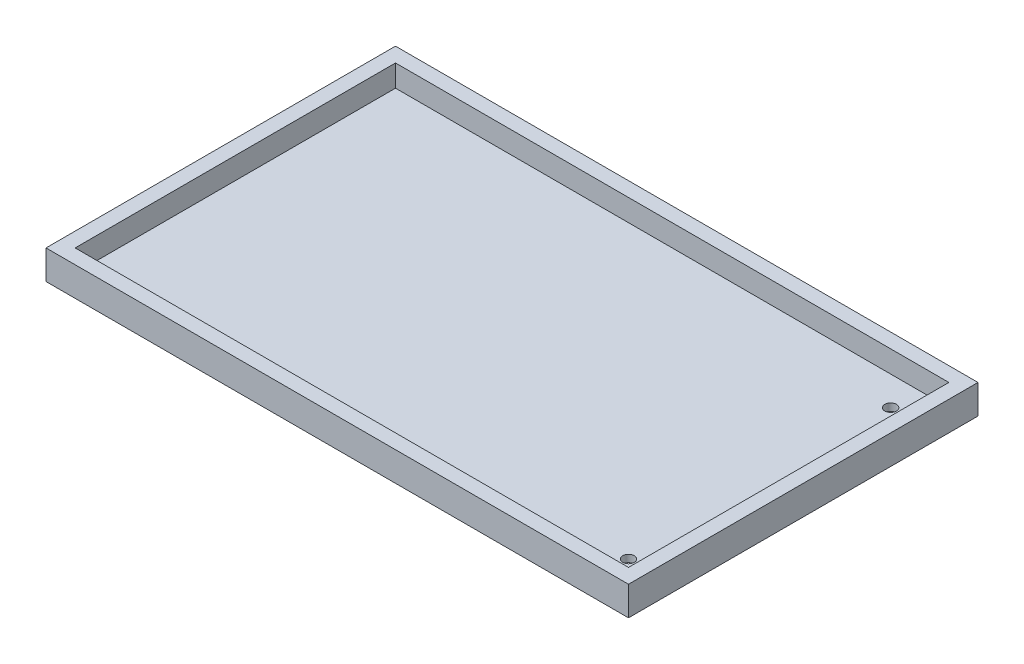
ISO-10303-21;
HEADER;
FILE_DESCRIPTION(('STEP AP214'),'2;1');
FILE_NAME('part.step','',(''),(''),'','','');
FILE_SCHEMA(('AUTOMOTIVE_DESIGN { 1 0 10303 214 1 1 1 1 }'));
ENDSEC;
DATA;
#1=APPLICATION_CONTEXT('core data for automotive mechanical design processes');
#2=APPLICATION_PROTOCOL_DEFINITION('international standard','automotive_design',2000,#1);
#3=PRODUCT_CONTEXT('',#1,'mechanical');
#4=PRODUCT('Part','Part','',(#3));
#5=PRODUCT_RELATED_PRODUCT_CATEGORY('part','',(#4));
#6=PRODUCT_DEFINITION_FORMATION('','',#4);
#7=PRODUCT_DEFINITION_CONTEXT('part definition',#1,'design');
#8=PRODUCT_DEFINITION('design','',#6,#7);
#9=PRODUCT_DEFINITION_SHAPE('','',#8);
#10=(LENGTH_UNIT() NAMED_UNIT(*) SI_UNIT(.MILLI.,.METRE.));
#11=(NAMED_UNIT(*) PLANE_ANGLE_UNIT() SI_UNIT($,.RADIAN.));
#12=(NAMED_UNIT(*) SI_UNIT($,.STERADIAN.) SOLID_ANGLE_UNIT());
#13=UNCERTAINTY_MEASURE_WITH_UNIT(LENGTH_MEASURE(1.E-05),#10,'distance_accuracy_value','');
#14=(GEOMETRIC_REPRESENTATION_CONTEXT(3) GLOBAL_UNCERTAINTY_ASSIGNED_CONTEXT((#13)) GLOBAL_UNIT_ASSIGNED_CONTEXT((#10,
#11,#12)) REPRESENTATION_CONTEXT('',''));
#15=CARTESIAN_POINT('',(0.,0.,0.));
#16=DIRECTION('',(0.,0.,1.));
#17=DIRECTION('',(1.,0.,0.));
#18=AXIS2_PLACEMENT_3D('',#15,#16,#17);
#19=CARTESIAN_POINT('',(-67.6959638652054,5.08,-25.0731617647059));
#20=DIRECTION('',(1.,0.,0.));
#21=DIRECTION('',(0.,0.,-1.));
#22=AXIS2_PLACEMENT_3D('',#19,#20,#21);
#23=PLANE('',#22);
#24=DIRECTION('',(0.,0.,1.));
#25=VECTOR('',#24,1.);
#26=CARTESIAN_POINT('',(-67.6959638652054,0.,-25.0731617647059));
#27=LINE('',#26,#25);
#28=CARTESIAN_POINT('',(-67.6959638652054,0.,-25.0731617647059));
#29=VERTEX_POINT('',#28);
#30=CARTESIAN_POINT('',(-67.6959638652054,0.,35.8868382352941));
#31=VERTEX_POINT('',#30);
#32=EDGE_CURVE('E161',#29,#31,#27,.T.);
#33=ORIENTED_EDGE('',*,*,#32,.T.);
#34=DIRECTION('',(0.,-1.,0.));
#35=VECTOR('',#34,1.);
#36=CARTESIAN_POINT('',(-67.6959638652054,5.08,35.8868382352941));
#37=LINE('',#36,#35);
#38=CARTESIAN_POINT('',(-67.6959638652054,5.08,35.8868382352941));
#39=VERTEX_POINT('',#38);
#40=EDGE_CURVE('E11',#39,#31,#37,.T.);
#41=ORIENTED_EDGE('',*,*,#40,.F.);
#42=DIRECTION('',(0.,0.,1.));
#43=VECTOR('',#42,1.);
#44=CARTESIAN_POINT('',(-67.6959638652054,5.08,-25.0731617647059));
#45=LINE('',#44,#43);
#46=CARTESIAN_POINT('',(-67.6959638652054,5.08,-25.0731617647059));
#47=VERTEX_POINT('',#46);
#48=EDGE_CURVE('E167',#47,#39,#45,.T.);
#49=ORIENTED_EDGE('',*,*,#48,.F.);
#50=DIRECTION('',(0.,-1.,0.));
#51=VECTOR('',#50,1.);
#52=CARTESIAN_POINT('',(-67.6959638652054,5.08,-25.0731617647059));
#53=LINE('',#52,#51);
#54=EDGE_CURVE('E177',#47,#29,#53,.T.);
#55=ORIENTED_EDGE('',*,*,#54,.T.);
#56=EDGE_LOOP('',(#33,#41,#49,#55));
#57=FACE_BOUND('',#56,.T.);
#58=ADVANCED_FACE('F39',(#57),#23,.F.);
#59=CARTESIAN_POINT('',(-67.6959638652054,5.08,35.8868382352941));
#60=DIRECTION('',(0.,0.,-1.));
#61=DIRECTION('',(-1.,0.,0.));
#62=AXIS2_PLACEMENT_3D('',#59,#60,#61);
#63=PLANE('',#62);
#64=DIRECTION('',(1.,0.,0.));
#65=VECTOR('',#64,1.);
#66=CARTESIAN_POINT('',(-67.6959638652054,0.,35.8868382352941));
#67=LINE('',#66,#65);
#68=CARTESIAN_POINT('',(33.9040361347946,0.,35.8868382352941));
#69=VERTEX_POINT('',#68);
#70=EDGE_CURVE('E181',#31,#69,#67,.T.);
#71=ORIENTED_EDGE('',*,*,#70,.T.);
#72=DIRECTION('',(0.,-1.,0.));
#73=VECTOR('',#72,1.);
#74=CARTESIAN_POINT('',(33.9040361347946,5.08,35.8868382352941));
#75=LINE('',#74,#73);
#76=CARTESIAN_POINT('',(33.9040361347946,5.08,35.8868382352941));
#77=VERTEX_POINT('',#76);
#78=EDGE_CURVE('E47',#77,#69,#75,.T.);
#79=ORIENTED_EDGE('',*,*,#78,.F.);
#80=DIRECTION('',(1.,0.,0.));
#81=VECTOR('',#80,1.);
#82=CARTESIAN_POINT('',(-67.6959638652054,5.08,35.8868382352941));
#83=LINE('',#82,#81);
#84=EDGE_CURVE('E91',#39,#77,#83,.T.);
#85=ORIENTED_EDGE('',*,*,#84,.F.);
#86=ORIENTED_EDGE('',*,*,#40,.T.);
#87=EDGE_LOOP('',(#71,#79,#85,#86));
#88=FACE_BOUND('',#87,.T.);
#89=ADVANCED_FACE('F216',(#88),#63,.F.);
#90=CARTESIAN_POINT('',(33.9040361347946,5.08,-25.0731617647059));
#91=DIRECTION('',(-1.,0.,0.));
#92=DIRECTION('',(0.,0.,1.));
#93=AXIS2_PLACEMENT_3D('',#90,#91,#92);
#94=PLANE('',#93);
#95=DIRECTION('',(0.,0.,-1.));
#96=VECTOR('',#95,1.);
#97=CARTESIAN_POINT('',(33.9040361347946,0.,-25.0731617647059));
#98=LINE('',#97,#96);
#99=CARTESIAN_POINT('',(33.9040361347946,0.,-25.0731617647059));
#100=VERTEX_POINT('',#99);
#101=EDGE_CURVE('E184',#69,#100,#98,.T.);
#102=ORIENTED_EDGE('',*,*,#101,.T.);
#103=DIRECTION('',(0.,-1.,0.));
#104=VECTOR('',#103,1.);
#105=CARTESIAN_POINT('',(33.9040361347946,5.08,-25.0731617647059));
#106=LINE('',#105,#104);
#107=CARTESIAN_POINT('',(33.9040361347946,5.08,-25.0731617647059));
#108=VERTEX_POINT('',#107);
#109=EDGE_CURVE('E191',#108,#100,#106,.T.);
#110=ORIENTED_EDGE('',*,*,#109,.F.);
#111=DIRECTION('',(0.,0.,-1.));
#112=VECTOR('',#111,1.);
#113=CARTESIAN_POINT('',(33.9040361347946,5.08,-25.0731617647059));
#114=LINE('',#113,#112);
#115=EDGE_CURVE('E172',#77,#108,#114,.T.);
#116=ORIENTED_EDGE('',*,*,#115,.F.);
#117=ORIENTED_EDGE('',*,*,#78,.T.);
#118=EDGE_LOOP('',(#102,#110,#116,#117));
#119=FACE_BOUND('',#118,.T.);
#120=ADVANCED_FACE('F198',(#119),#94,.F.);
#121=CARTESIAN_POINT('',(-67.6959638652054,5.08,-25.0731617647059));
#122=DIRECTION('',(0.,0.,1.));
#123=DIRECTION('',(1.,0.,0.));
#124=AXIS2_PLACEMENT_3D('',#121,#122,#123);
#125=PLANE('',#124);
#126=DIRECTION('',(-1.,0.,0.));
#127=VECTOR('',#126,1.);
#128=CARTESIAN_POINT('',(-67.6959638652054,0.,-25.0731617647059));
#129=LINE('',#128,#127);
#130=EDGE_CURVE('E84',#100,#29,#129,.T.);
#131=ORIENTED_EDGE('',*,*,#130,.T.);
#132=ORIENTED_EDGE('',*,*,#54,.F.);
#133=DIRECTION('',(-1.,0.,0.));
#134=VECTOR('',#133,1.);
#135=CARTESIAN_POINT('',(-67.6959638652054,5.08,-25.0731617647059));
#136=LINE('',#135,#134);
#137=EDGE_CURVE('E63',#108,#47,#136,.T.);
#138=ORIENTED_EDGE('',*,*,#137,.F.);
#139=ORIENTED_EDGE('',*,*,#109,.T.);
#140=EDGE_LOOP('',(#131,#132,#138,#139));
#141=FACE_BOUND('',#140,.T.);
#142=ADVANCED_FACE('F206',(#141),#125,.F.);
#143=CARTESIAN_POINT('',(0.,5.08,0.));
#144=DIRECTION('',(0.,1.,0.));
#145=DIRECTION('',(0.,0.,1.));
#146=AXIS2_PLACEMENT_3D('',#143,#144,#145);
#147=PLANE('',#146);
#148=DIRECTION('',(0.,0.,1.));
#149=VECTOR('',#148,1.);
#150=CARTESIAN_POINT('',(-65.1559638652054,5.08,-22.5331617647059));
#151=LINE('',#150,#149);
#152=CARTESIAN_POINT('',(-65.1559638652054,5.08,-22.5331617647059));
#153=VERTEX_POINT('',#152);
#154=CARTESIAN_POINT('',(-65.1559638652054,5.08,33.3468382352941));
#155=VERTEX_POINT('',#154);
#156=EDGE_CURVE('E54',#153,#155,#151,.T.);
#157=ORIENTED_EDGE('',*,*,#156,.F.);
#158=DIRECTION('',(-1.,0.,0.));
#159=VECTOR('',#158,1.);
#160=CARTESIAN_POINT('',(-65.1559638652054,5.08,-22.5331617647059));
#161=LINE('',#160,#159);
#162=CARTESIAN_POINT('',(31.3640361347946,5.08,-22.5331617647059));
#163=VERTEX_POINT('',#162);
#164=EDGE_CURVE('E136',#163,#153,#161,.T.);
#165=ORIENTED_EDGE('',*,*,#164,.F.);
#166=DIRECTION('',(0.,0.,-1.));
#167=VECTOR('',#166,1.);
#168=CARTESIAN_POINT('',(31.3640361347946,5.08,-22.5331617647059));
#169=LINE('',#168,#167);
#170=CARTESIAN_POINT('',(31.3640361347946,5.08,33.3468382352941));
#171=VERTEX_POINT('',#170);
#172=EDGE_CURVE('E140',#171,#163,#169,.T.);
#173=ORIENTED_EDGE('',*,*,#172,.F.);
#174=DIRECTION('',(1.,0.,0.));
#175=VECTOR('',#174,1.);
#176=CARTESIAN_POINT('',(-65.1559638652054,5.08,33.3468382352941));
#177=LINE('',#176,#175);
#178=EDGE_CURVE('E152',#155,#171,#177,.T.);
#179=ORIENTED_EDGE('',*,*,#178,.F.);
#180=EDGE_LOOP('',(#157,#165,#173,#179));
#181=FACE_BOUND('',#180,.T.);
#182=ORIENTED_EDGE('',*,*,#48,.T.);
#183=ORIENTED_EDGE('',*,*,#84,.T.);
#184=ORIENTED_EDGE('',*,*,#115,.T.);
#185=ORIENTED_EDGE('',*,*,#137,.T.);
#186=EDGE_LOOP('',(#182,#183,#184,#185));
#187=FACE_BOUND('',#186,.T.);
#188=ADVANCED_FACE('F208',(#181,#187),#147,.T.);
#189=CARTESIAN_POINT('',(0.,0.,0.));
#190=DIRECTION('',(0.,1.,0.));
#191=DIRECTION('',(0.,0.,1.));
#192=AXIS2_PLACEMENT_3D('',#189,#190,#191);
#193=PLANE('',#192);
#194=CARTESIAN_POINT('',(26.2840361347946,0.,-17.4531617647059));
#195=DIRECTION('',(0.,1.,0.));
#196=DIRECTION('',(0.,0.,1.));
#197=AXIS2_PLACEMENT_3D('',#194,#195,#196);
#198=CIRCLE('',#197,1.016);
#199=CARTESIAN_POINT('',(26.2840361347946,0.,-16.4371617647059));
#200=VERTEX_POINT('',#199);
#201=EDGE_CURVE('E143',#200,#200,#198,.T.);
#202=ORIENTED_EDGE('',*,*,#201,.T.);
#203=EDGE_LOOP('',(#202));
#204=FACE_BOUND('',#203,.T.);
#205=CARTESIAN_POINT('',(26.2840361347946,0.,28.2668382352941));
#206=DIRECTION('',(0.,1.,0.));
#207=DIRECTION('',(0.,0.,1.));
#208=AXIS2_PLACEMENT_3D('',#205,#206,#207);
#209=CIRCLE('',#208,1.016);
#210=CARTESIAN_POINT('',(26.2840361347946,0.,29.2828382352941));
#211=VERTEX_POINT('',#210);
#212=EDGE_CURVE('E323',#211,#211,#209,.T.);
#213=ORIENTED_EDGE('',*,*,#212,.T.);
#214=EDGE_LOOP('',(#213));
#215=FACE_BOUND('',#214,.T.);
#216=ORIENTED_EDGE('',*,*,#32,.F.);
#217=ORIENTED_EDGE('',*,*,#130,.F.);
#218=ORIENTED_EDGE('',*,*,#101,.F.);
#219=ORIENTED_EDGE('',*,*,#70,.F.);
#220=EDGE_LOOP('',(#216,#217,#218,#219));
#221=FACE_BOUND('',#220,.T.);
#222=ADVANCED_FACE('F202',(#204,#215,#221),#193,.F.);
#223=CARTESIAN_POINT('',(-65.1559638652054,1.27,-22.5331617647059));
#224=DIRECTION('',(-1.,0.,0.));
#225=DIRECTION('',(0.,0.,1.));
#226=AXIS2_PLACEMENT_3D('',#223,#224,#225);
#227=PLANE('',#226);
#228=ORIENTED_EDGE('',*,*,#156,.T.);
#229=DIRECTION('',(0.,1.,0.));
#230=VECTOR('',#229,1.);
#231=CARTESIAN_POINT('',(-65.1559638652054,1.27,33.3468382352941));
#232=LINE('',#231,#230);
#233=CARTESIAN_POINT('',(-65.1559638652054,1.27,33.3468382352941));
#234=VERTEX_POINT('',#233);
#235=EDGE_CURVE('E111',#234,#155,#232,.T.);
#236=ORIENTED_EDGE('',*,*,#235,.F.);
#237=DIRECTION('',(0.,0.,1.));
#238=VECTOR('',#237,1.);
#239=CARTESIAN_POINT('',(-65.1559638652054,1.27,-22.5331617647059));
#240=LINE('',#239,#238);
#241=CARTESIAN_POINT('',(-65.1559638652054,1.27,-22.5331617647059));
#242=VERTEX_POINT('',#241);
#243=EDGE_CURVE('E115',#242,#234,#240,.T.);
#244=ORIENTED_EDGE('',*,*,#243,.F.);
#245=DIRECTION('',(0.,1.,0.));
#246=VECTOR('',#245,1.);
#247=CARTESIAN_POINT('',(-65.1559638652054,1.27,-22.5331617647059));
#248=LINE('',#247,#246);
#249=EDGE_CURVE('E158',#242,#153,#248,.T.);
#250=ORIENTED_EDGE('',*,*,#249,.T.);
#251=EDGE_LOOP('',(#228,#236,#244,#250));
#252=FACE_BOUND('',#251,.T.);
#253=ADVANCED_FACE('F113',(#252),#227,.F.);
#254=CARTESIAN_POINT('',(-65.1559638652054,1.27,-22.5331617647059));
#255=DIRECTION('',(0.,0.,-1.));
#256=DIRECTION('',(-1.,0.,0.));
#257=AXIS2_PLACEMENT_3D('',#254,#255,#256);
#258=PLANE('',#257);
#259=ORIENTED_EDGE('',*,*,#164,.T.);
#260=ORIENTED_EDGE('',*,*,#249,.F.);
#261=DIRECTION('',(-1.,0.,0.));
#262=VECTOR('',#261,1.);
#263=CARTESIAN_POINT('',(-65.1559638652054,1.27,-22.5331617647059));
#264=LINE('',#263,#262);
#265=CARTESIAN_POINT('',(31.3640361347946,1.27,-22.5331617647059));
#266=VERTEX_POINT('',#265);
#267=EDGE_CURVE('E122',#266,#242,#264,.T.);
#268=ORIENTED_EDGE('',*,*,#267,.F.);
#269=DIRECTION('',(0.,1.,0.));
#270=VECTOR('',#269,1.);
#271=CARTESIAN_POINT('',(31.3640361347946,1.27,-22.5331617647059));
#272=LINE('',#271,#270);
#273=EDGE_CURVE('E162',#266,#163,#272,.T.);
#274=ORIENTED_EDGE('',*,*,#273,.T.);
#275=EDGE_LOOP('',(#259,#260,#268,#274));
#276=FACE_BOUND('',#275,.T.);
#277=ADVANCED_FACE('F250',(#276),#258,.F.);
#278=CARTESIAN_POINT('',(31.3640361347946,1.27,-22.5331617647059));
#279=DIRECTION('',(1.,0.,0.));
#280=DIRECTION('',(0.,0.,-1.));
#281=AXIS2_PLACEMENT_3D('',#278,#279,#280);
#282=PLANE('',#281);
#283=ORIENTED_EDGE('',*,*,#172,.T.);
#284=ORIENTED_EDGE('',*,*,#273,.F.);
#285=DIRECTION('',(0.,0.,-1.));
#286=VECTOR('',#285,1.);
#287=CARTESIAN_POINT('',(31.3640361347946,1.27,-22.5331617647059));
#288=LINE('',#287,#286);
#289=CARTESIAN_POINT('',(31.3640361347946,1.27,33.3468382352941));
#290=VERTEX_POINT('',#289);
#291=EDGE_CURVE('E131',#290,#266,#288,.T.);
#292=ORIENTED_EDGE('',*,*,#291,.F.);
#293=DIRECTION('',(0.,1.,0.));
#294=VECTOR('',#293,1.);
#295=CARTESIAN_POINT('',(31.3640361347946,1.27,33.3468382352941));
#296=LINE('',#295,#294);
#297=EDGE_CURVE('E121',#290,#171,#296,.T.);
#298=ORIENTED_EDGE('',*,*,#297,.T.);
#299=EDGE_LOOP('',(#283,#284,#292,#298));
#300=FACE_BOUND('',#299,.T.);
#301=ADVANCED_FACE('F259',(#300),#282,.F.);
#302=CARTESIAN_POINT('',(-65.1559638652054,1.27,33.3468382352941));
#303=DIRECTION('',(0.,0.,1.));
#304=DIRECTION('',(1.,0.,0.));
#305=AXIS2_PLACEMENT_3D('',#302,#303,#304);
#306=PLANE('',#305);
#307=ORIENTED_EDGE('',*,*,#178,.T.);
#308=ORIENTED_EDGE('',*,*,#297,.F.);
#309=DIRECTION('',(1.,0.,0.));
#310=VECTOR('',#309,1.);
#311=CARTESIAN_POINT('',(-65.1559638652054,1.27,33.3468382352941));
#312=LINE('',#311,#310);
#313=EDGE_CURVE('E125',#234,#290,#312,.T.);
#314=ORIENTED_EDGE('',*,*,#313,.F.);
#315=ORIENTED_EDGE('',*,*,#235,.T.);
#316=EDGE_LOOP('',(#307,#308,#314,#315));
#317=FACE_BOUND('',#316,.T.);
#318=ADVANCED_FACE('F126',(#317),#306,.F.);
#319=CARTESIAN_POINT('',(0.,1.27,0.));
#320=DIRECTION('',(0.,1.,0.));
#321=DIRECTION('',(0.,0.,1.));
#322=AXIS2_PLACEMENT_3D('',#319,#320,#321);
#323=PLANE('',#322);
#324=CARTESIAN_POINT('',(26.2840361347946,1.27,-17.4531617647059));
#325=DIRECTION('',(0.,1.,0.));
#326=DIRECTION('',(0.,0.,1.));
#327=AXIS2_PLACEMENT_3D('',#324,#325,#326);
#328=CIRCLE('',#327,1.016);
#329=CARTESIAN_POINT('',(26.2840361347946,1.27,-16.4371617647059));
#330=VERTEX_POINT('',#329);
#331=EDGE_CURVE('E319',#330,#330,#328,.T.);
#332=ORIENTED_EDGE('',*,*,#331,.F.);
#333=EDGE_LOOP('',(#332));
#334=FACE_BOUND('',#333,.T.);
#335=CARTESIAN_POINT('',(26.2840361347946,1.27,28.2668382352941));
#336=DIRECTION('',(0.,1.,0.));
#337=DIRECTION('',(0.,0.,1.));
#338=AXIS2_PLACEMENT_3D('',#335,#336,#337);
#339=CIRCLE('',#338,1.016);
#340=CARTESIAN_POINT('',(26.2840361347946,1.27,29.2828382352941));
#341=VERTEX_POINT('',#340);
#342=EDGE_CURVE('E329',#341,#341,#339,.T.);
#343=ORIENTED_EDGE('',*,*,#342,.F.);
#344=EDGE_LOOP('',(#343));
#345=FACE_BOUND('',#344,.T.);
#346=ORIENTED_EDGE('',*,*,#243,.T.);
#347=ORIENTED_EDGE('',*,*,#313,.T.);
#348=ORIENTED_EDGE('',*,*,#291,.T.);
#349=ORIENTED_EDGE('',*,*,#267,.T.);
#350=EDGE_LOOP('',(#346,#347,#348,#349));
#351=FACE_BOUND('',#350,.T.);
#352=ADVANCED_FACE('F133',(#334,#345,#351),#323,.T.);
#353=CARTESIAN_POINT('',(26.2840361347946,-10.16,28.2668382352941));
#354=DIRECTION('',(0.,1.,0.));
#355=DIRECTION('',(0.,0.,1.));
#356=AXIS2_PLACEMENT_3D('',#353,#354,#355);
#357=CYLINDRICAL_SURFACE('',#356,1.016);
#358=ORIENTED_EDGE('',*,*,#342,.T.);
#359=EDGE_LOOP('',(#358));
#360=FACE_BOUND('',#359,.T.);
#361=ORIENTED_EDGE('',*,*,#212,.F.);
#362=EDGE_LOOP('',(#361));
#363=FACE_BOUND('',#362,.T.);
#364=ADVANCED_FACE('F292',(#360,#363),#357,.F.);
#365=CARTESIAN_POINT('',(26.2840361347946,-10.16,-17.4531617647059));
#366=DIRECTION('',(0.,1.,0.));
#367=DIRECTION('',(0.,0.,1.));
#368=AXIS2_PLACEMENT_3D('',#365,#366,#367);
#369=CYLINDRICAL_SURFACE('',#368,1.016);
#370=ORIENTED_EDGE('',*,*,#331,.T.);
#371=EDGE_LOOP('',(#370));
#372=FACE_BOUND('',#371,.T.);
#373=ORIENTED_EDGE('',*,*,#201,.F.);
#374=EDGE_LOOP('',(#373));
#375=FACE_BOUND('',#374,.T.);
#376=ADVANCED_FACE('F302',(#372,#375),#369,.F.);
#377=CLOSED_SHELL('',(#58,#89,#120,#142,#188,#222,#253,#277,#301,#318,#352,#364,#376));
#378=MANIFOLD_SOLID_BREP('B2',#377);
#379=ADVANCED_BREP_SHAPE_REPRESENTATION('',(#18,#378),#14);
#380=SHAPE_DEFINITION_REPRESENTATION(#9,#379);
ENDSEC;
END-ISO-10303-21;
